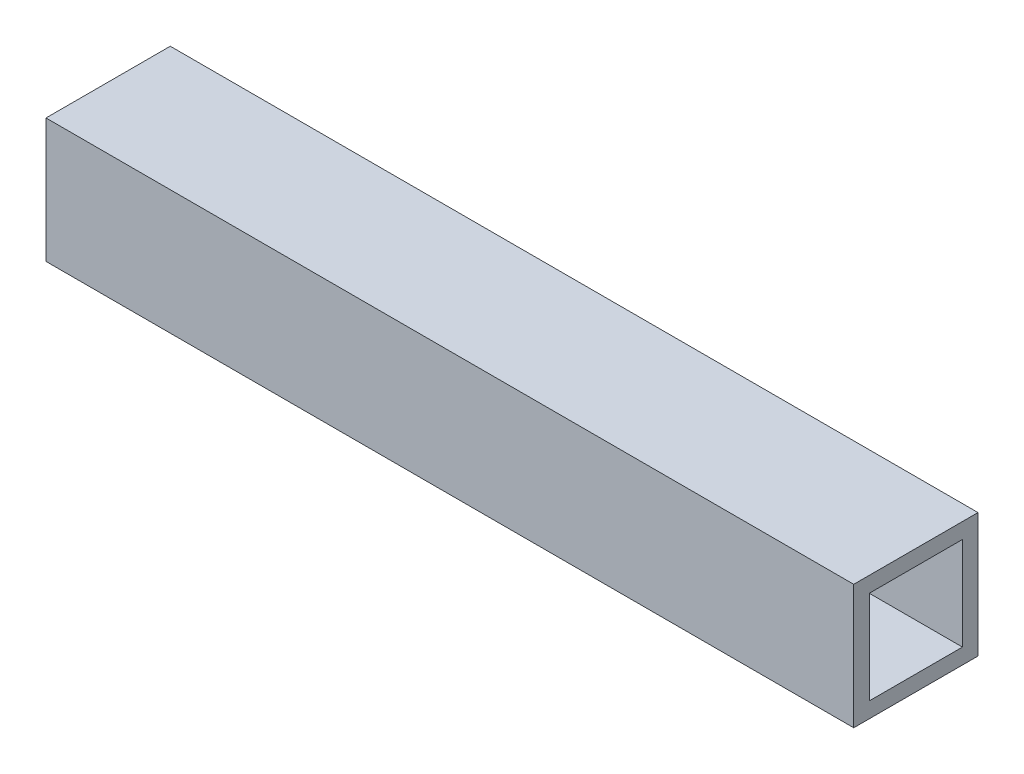
ISO-10303-21;
HEADER;
FILE_DESCRIPTION(('STEP AP214'),'2;1');
FILE_NAME('part.step','',(''),(''),'','','');
FILE_SCHEMA(('AUTOMOTIVE_DESIGN { 1 0 10303 214 1 1 1 1 }'));
ENDSEC;
DATA;
#1=APPLICATION_CONTEXT('core data for automotive mechanical design processes');
#2=APPLICATION_PROTOCOL_DEFINITION('international standard','automotive_design',2000,#1);
#3=PRODUCT_CONTEXT('',#1,'mechanical');
#4=PRODUCT('Part','Part','',(#3));
#5=PRODUCT_RELATED_PRODUCT_CATEGORY('part','',(#4));
#6=PRODUCT_DEFINITION_FORMATION('','',#4);
#7=PRODUCT_DEFINITION_CONTEXT('part definition',#1,'design');
#8=PRODUCT_DEFINITION('design','',#6,#7);
#9=PRODUCT_DEFINITION_SHAPE('','',#8);
#10=(LENGTH_UNIT() NAMED_UNIT(*) SI_UNIT(.MILLI.,.METRE.));
#11=(NAMED_UNIT(*) PLANE_ANGLE_UNIT() SI_UNIT($,.RADIAN.));
#12=(NAMED_UNIT(*) SI_UNIT($,.STERADIAN.) SOLID_ANGLE_UNIT());
#13=UNCERTAINTY_MEASURE_WITH_UNIT(LENGTH_MEASURE(1.E-05),#10,'distance_accuracy_value','');
#14=(GEOMETRIC_REPRESENTATION_CONTEXT(3) GLOBAL_UNCERTAINTY_ASSIGNED_CONTEXT((#13)) GLOBAL_UNIT_ASSIGNED_CONTEXT((#10,
#11,#12)) REPRESENTATION_CONTEXT('',''));
#15=CARTESIAN_POINT('',(0.,0.,0.));
#16=DIRECTION('',(0.,0.,1.));
#17=DIRECTION('',(1.,0.,0.));
#18=AXIS2_PLACEMENT_3D('',#15,#16,#17);
#19=CARTESIAN_POINT('',(165.1,-209.55,22.4741790443659));
#20=DIRECTION('',(0.,-1.,0.));
#21=DIRECTION('',(0.,0.,-1.));
#22=AXIS2_PLACEMENT_3D('',#19,#20,#21);
#23=PLANE('',#22);
#24=DIRECTION('',(0.,0.,1.));
#25=VECTOR('',#24,1.);
#26=CARTESIAN_POINT('',(-165.1,-209.55,22.4741790443659));
#27=LINE('',#26,#25);
#28=CARTESIAN_POINT('',(-165.1,-209.55,6.35));
#29=VERTEX_POINT('',#28);
#30=CARTESIAN_POINT('',(-165.1,-209.55,44.45));
#31=VERTEX_POINT('',#30);
#32=EDGE_CURVE('E156',#29,#31,#27,.T.);
#33=ORIENTED_EDGE('',*,*,#32,.T.);
#34=DIRECTION('',(-1.,0.,0.));
#35=VECTOR('',#34,1.);
#36=CARTESIAN_POINT('',(165.1,-209.55,44.45));
#37=LINE('',#36,#35);
#38=CARTESIAN_POINT('',(165.1,-209.55,44.45));
#39=VERTEX_POINT('',#38);
#40=EDGE_CURVE('E9',#39,#31,#37,.T.);
#41=ORIENTED_EDGE('',*,*,#40,.F.);
#42=DIRECTION('',(0.,0.,1.));
#43=VECTOR('',#42,1.);
#44=CARTESIAN_POINT('',(165.1,-209.55,22.4741790443659));
#45=LINE('',#44,#43);
#46=CARTESIAN_POINT('',(165.1,-209.55,6.35));
#47=VERTEX_POINT('',#46);
#48=EDGE_CURVE('E117',#47,#39,#45,.T.);
#49=ORIENTED_EDGE('',*,*,#48,.F.);
#50=DIRECTION('',(-1.,0.,0.));
#51=VECTOR('',#50,1.);
#52=CARTESIAN_POINT('',(165.1,-209.55,6.35));
#53=LINE('',#52,#51);
#54=EDGE_CURVE('E39',#47,#29,#53,.T.);
#55=ORIENTED_EDGE('',*,*,#54,.T.);
#56=EDGE_LOOP('',(#33,#41,#49,#55));
#57=FACE_BOUND('',#56,.T.);
#58=ADVANCED_FACE('F14',(#57),#23,.F.);
#59=CARTESIAN_POINT('',(165.1,-190.5,44.45));
#60=DIRECTION('',(0.,0.,1.));
#61=DIRECTION('',(1.,0.,0.));
#62=AXIS2_PLACEMENT_3D('',#59,#60,#61);
#63=PLANE('',#62);
#64=DIRECTION('',(0.,1.,0.));
#65=VECTOR('',#64,1.);
#66=CARTESIAN_POINT('',(-165.1,-190.5,44.45));
#67=LINE('',#66,#65);
#68=CARTESIAN_POINT('',(-165.1,-171.45,44.45));
#69=VERTEX_POINT('',#68);
#70=EDGE_CURVE('E124',#31,#69,#67,.T.);
#71=ORIENTED_EDGE('',*,*,#70,.T.);
#72=DIRECTION('',(-1.,0.,0.));
#73=VECTOR('',#72,1.);
#74=CARTESIAN_POINT('',(165.1,-171.45,44.45));
#75=LINE('',#74,#73);
#76=CARTESIAN_POINT('',(165.1,-171.45,44.45));
#77=VERTEX_POINT('',#76);
#78=EDGE_CURVE('E25',#77,#69,#75,.T.);
#79=ORIENTED_EDGE('',*,*,#78,.F.);
#80=DIRECTION('',(0.,1.,0.));
#81=VECTOR('',#80,1.);
#82=CARTESIAN_POINT('',(165.1,-190.5,44.45));
#83=LINE('',#82,#81);
#84=EDGE_CURVE('E111',#39,#77,#83,.T.);
#85=ORIENTED_EDGE('',*,*,#84,.F.);
#86=ORIENTED_EDGE('',*,*,#40,.T.);
#87=EDGE_LOOP('',(#71,#79,#85,#86));
#88=FACE_BOUND('',#87,.T.);
#89=ADVANCED_FACE('F123',(#88),#63,.F.);
#90=CARTESIAN_POINT('',(165.1,-171.45,22.4741790443659));
#91=DIRECTION('',(0.,-1.,0.));
#92=DIRECTION('',(0.,0.,-1.));
#93=AXIS2_PLACEMENT_3D('',#90,#91,#92);
#94=PLANE('',#93);
#95=DIRECTION('',(0.,0.,1.));
#96=VECTOR('',#95,1.);
#97=CARTESIAN_POINT('',(-165.1,-171.45,22.4741790443659));
#98=LINE('',#97,#96);
#99=CARTESIAN_POINT('',(-165.1,-171.45,6.35));
#100=VERTEX_POINT('',#99);
#101=EDGE_CURVE('E160',#100,#69,#98,.T.);
#102=ORIENTED_EDGE('',*,*,#101,.F.);
#103=DIRECTION('',(-1.,0.,0.));
#104=VECTOR('',#103,1.);
#105=CARTESIAN_POINT('',(165.1,-171.45,6.35));
#106=LINE('',#105,#104);
#107=CARTESIAN_POINT('',(165.1,-171.45,6.35));
#108=VERTEX_POINT('',#107);
#109=EDGE_CURVE('E74',#108,#100,#106,.T.);
#110=ORIENTED_EDGE('',*,*,#109,.F.);
#111=DIRECTION('',(0.,0.,1.));
#112=VECTOR('',#111,1.);
#113=CARTESIAN_POINT('',(165.1,-171.45,22.4741790443659));
#114=LINE('',#113,#112);
#115=EDGE_CURVE('E116',#108,#77,#114,.T.);
#116=ORIENTED_EDGE('',*,*,#115,.T.);
#117=ORIENTED_EDGE('',*,*,#78,.T.);
#118=EDGE_LOOP('',(#102,#110,#116,#117));
#119=FACE_BOUND('',#118,.T.);
#120=ADVANCED_FACE('F129',(#119),#94,.T.);
#121=CARTESIAN_POINT('',(165.1,-190.5,50.8));
#122=DIRECTION('',(0.,0.,1.));
#123=DIRECTION('',(1.,0.,0.));
#124=AXIS2_PLACEMENT_3D('',#121,#122,#123);
#125=PLANE('',#124);
#126=DIRECTION('',(0.,1.,0.));
#127=VECTOR('',#126,1.);
#128=CARTESIAN_POINT('',(-165.1,-190.5,50.8));
#129=LINE('',#128,#127);
#130=CARTESIAN_POINT('',(-165.1,-215.9,50.8));
#131=VERTEX_POINT('',#130);
#132=CARTESIAN_POINT('',(-165.1,-165.1,50.8));
#133=VERTEX_POINT('',#132);
#134=EDGE_CURVE('E141',#131,#133,#129,.T.);
#135=ORIENTED_EDGE('',*,*,#134,.F.);
#136=DIRECTION('',(-1.,0.,0.));
#137=VECTOR('',#136,1.);
#138=CARTESIAN_POINT('',(165.1,-215.9,50.8));
#139=LINE('',#138,#137);
#140=CARTESIAN_POINT('',(165.1,-215.9,50.8));
#141=VERTEX_POINT('',#140);
#142=EDGE_CURVE('E18',#141,#131,#139,.T.);
#143=ORIENTED_EDGE('',*,*,#142,.F.);
#144=DIRECTION('',(0.,1.,0.));
#145=VECTOR('',#144,1.);
#146=CARTESIAN_POINT('',(165.1,-190.5,50.8));
#147=LINE('',#146,#145);
#148=CARTESIAN_POINT('',(165.1,-165.1,50.8));
#149=VERTEX_POINT('',#148);
#150=EDGE_CURVE('E166',#141,#149,#147,.T.);
#151=ORIENTED_EDGE('',*,*,#150,.T.);
#152=DIRECTION('',(-1.,0.,0.));
#153=VECTOR('',#152,1.);
#154=CARTESIAN_POINT('',(165.1,-165.1,50.8));
#155=LINE('',#154,#153);
#156=EDGE_CURVE('E137',#149,#133,#155,.T.);
#157=ORIENTED_EDGE('',*,*,#156,.T.);
#158=EDGE_LOOP('',(#135,#143,#151,#157));
#159=FACE_BOUND('',#158,.T.);
#160=ADVANCED_FACE('F16',(#159),#125,.T.);
#161=CARTESIAN_POINT('',(165.1,-215.9,2082.8));
#162=DIRECTION('',(0.,1.,0.));
#163=DIRECTION('',(0.,0.,1.));
#164=AXIS2_PLACEMENT_3D('',#161,#162,#163);
#165=PLANE('',#164);
#166=DIRECTION('',(0.,0.,-1.));
#167=VECTOR('',#166,1.);
#168=CARTESIAN_POINT('',(-165.1,-215.9,2082.8));
#169=LINE('',#168,#167);
#170=CARTESIAN_POINT('',(-165.1,-215.9,0.));
#171=VERTEX_POINT('',#170);
#172=EDGE_CURVE('E145',#131,#171,#169,.T.);
#173=ORIENTED_EDGE('',*,*,#172,.T.);
#174=DIRECTION('',(-1.,0.,0.));
#175=VECTOR('',#174,1.);
#176=CARTESIAN_POINT('',(165.1,-215.9,0.));
#177=LINE('',#176,#175);
#178=CARTESIAN_POINT('',(165.1,-215.9,0.));
#179=VERTEX_POINT('',#178);
#180=EDGE_CURVE('E175',#179,#171,#177,.T.);
#181=ORIENTED_EDGE('',*,*,#180,.F.);
#182=DIRECTION('',(0.,0.,-1.));
#183=VECTOR('',#182,1.);
#184=CARTESIAN_POINT('',(165.1,-215.9,2082.8));
#185=LINE('',#184,#183);
#186=EDGE_CURVE('E187',#141,#179,#185,.T.);
#187=ORIENTED_EDGE('',*,*,#186,.F.);
#188=ORIENTED_EDGE('',*,*,#142,.T.);
#189=EDGE_LOOP('',(#173,#181,#187,#188));
#190=FACE_BOUND('',#189,.T.);
#191=ADVANCED_FACE('F186',(#190),#165,.F.);
#192=CARTESIAN_POINT('',(165.1,-190.5,0.));
#193=DIRECTION('',(0.,0.,1.));
#194=DIRECTION('',(1.,0.,0.));
#195=AXIS2_PLACEMENT_3D('',#192,#193,#194);
#196=PLANE('',#195);
#197=DIRECTION('',(0.,1.,0.));
#198=VECTOR('',#197,1.);
#199=CARTESIAN_POINT('',(-165.1,-190.5,0.));
#200=LINE('',#199,#198);
#201=CARTESIAN_POINT('',(-165.1,-165.1,0.));
#202=VERTEX_POINT('',#201);
#203=EDGE_CURVE('E148',#171,#202,#200,.T.);
#204=ORIENTED_EDGE('',*,*,#203,.T.);
#205=DIRECTION('',(-1.,0.,0.));
#206=VECTOR('',#205,1.);
#207=CARTESIAN_POINT('',(165.1,-165.1,0.));
#208=LINE('',#207,#206);
#209=CARTESIAN_POINT('',(165.1,-165.1,0.));
#210=VERTEX_POINT('',#209);
#211=EDGE_CURVE('E173',#210,#202,#208,.T.);
#212=ORIENTED_EDGE('',*,*,#211,.F.);
#213=DIRECTION('',(0.,1.,0.));
#214=VECTOR('',#213,1.);
#215=CARTESIAN_POINT('',(165.1,-190.5,0.));
#216=LINE('',#215,#214);
#217=EDGE_CURVE('E230',#179,#210,#216,.T.);
#218=ORIENTED_EDGE('',*,*,#217,.F.);
#219=ORIENTED_EDGE('',*,*,#180,.T.);
#220=EDGE_LOOP('',(#204,#212,#218,#219));
#221=FACE_BOUND('',#220,.T.);
#222=ADVANCED_FACE('F199',(#221),#196,.F.);
#223=CARTESIAN_POINT('',(165.1,-165.1,2082.8));
#224=DIRECTION('',(0.,1.,0.));
#225=DIRECTION('',(0.,0.,1.));
#226=AXIS2_PLACEMENT_3D('',#223,#224,#225);
#227=PLANE('',#226);
#228=DIRECTION('',(0.,0.,-1.));
#229=VECTOR('',#228,1.);
#230=CARTESIAN_POINT('',(-165.1,-165.1,2082.8));
#231=LINE('',#230,#229);
#232=EDGE_CURVE('E152',#133,#202,#231,.T.);
#233=ORIENTED_EDGE('',*,*,#232,.F.);
#234=ORIENTED_EDGE('',*,*,#156,.F.);
#235=DIRECTION('',(0.,0.,-1.));
#236=VECTOR('',#235,1.);
#237=CARTESIAN_POINT('',(165.1,-165.1,2082.8));
#238=LINE('',#237,#236);
#239=EDGE_CURVE('E197',#149,#210,#238,.T.);
#240=ORIENTED_EDGE('',*,*,#239,.T.);
#241=ORIENTED_EDGE('',*,*,#211,.T.);
#242=EDGE_LOOP('',(#233,#234,#240,#241));
#243=FACE_BOUND('',#242,.T.);
#244=ADVANCED_FACE('F196',(#243),#227,.T.);
#245=CARTESIAN_POINT('',(165.1,-190.5,6.35));
#246=DIRECTION('',(0.,0.,1.));
#247=DIRECTION('',(1.,0.,0.));
#248=AXIS2_PLACEMENT_3D('',#245,#246,#247);
#249=PLANE('',#248);
#250=DIRECTION('',(0.,1.,0.));
#251=VECTOR('',#250,1.);
#252=CARTESIAN_POINT('',(-165.1,-190.5,6.35));
#253=LINE('',#252,#251);
#254=EDGE_CURVE('E162',#29,#100,#253,.T.);
#255=ORIENTED_EDGE('',*,*,#254,.F.);
#256=ORIENTED_EDGE('',*,*,#54,.F.);
#257=DIRECTION('',(0.,1.,0.));
#258=VECTOR('',#257,1.);
#259=CARTESIAN_POINT('',(165.1,-190.5,6.35));
#260=LINE('',#259,#258);
#261=EDGE_CURVE('E131',#47,#108,#260,.T.);
#262=ORIENTED_EDGE('',*,*,#261,.T.);
#263=ORIENTED_EDGE('',*,*,#109,.T.);
#264=EDGE_LOOP('',(#255,#256,#262,#263));
#265=FACE_BOUND('',#264,.T.);
#266=ADVANCED_FACE('F207',(#265),#249,.T.);
#267=CARTESIAN_POINT('',(165.1,-190.5,1041.4));
#268=DIRECTION('',(1.,0.,0.));
#269=DIRECTION('',(0.,1.,0.));
#270=AXIS2_PLACEMENT_3D('',#267,#268,#269);
#271=PLANE('',#270);
#272=ORIENTED_EDGE('',*,*,#150,.F.);
#273=ORIENTED_EDGE('',*,*,#186,.T.);
#274=ORIENTED_EDGE('',*,*,#217,.T.);
#275=ORIENTED_EDGE('',*,*,#239,.F.);
#276=EDGE_LOOP('',(#272,#273,#274,#275));
#277=FACE_BOUND('',#276,.T.);
#278=ORIENTED_EDGE('',*,*,#48,.T.);
#279=ORIENTED_EDGE('',*,*,#84,.T.);
#280=ORIENTED_EDGE('',*,*,#115,.F.);
#281=ORIENTED_EDGE('',*,*,#261,.F.);
#282=EDGE_LOOP('',(#278,#279,#280,#281));
#283=FACE_BOUND('',#282,.T.);
#284=ADVANCED_FACE('F113',(#277,#283),#271,.T.);
#285=CARTESIAN_POINT('',(-165.1,-190.5,1041.4));
#286=DIRECTION('',(1.,0.,0.));
#287=DIRECTION('',(0.,1.,0.));
#288=AXIS2_PLACEMENT_3D('',#285,#286,#287);
#289=PLANE('',#288);
#290=ORIENTED_EDGE('',*,*,#134,.T.);
#291=ORIENTED_EDGE('',*,*,#232,.T.);
#292=ORIENTED_EDGE('',*,*,#203,.F.);
#293=ORIENTED_EDGE('',*,*,#172,.F.);
#294=EDGE_LOOP('',(#290,#291,#292,#293));
#295=FACE_BOUND('',#294,.T.);
#296=ORIENTED_EDGE('',*,*,#32,.F.);
#297=ORIENTED_EDGE('',*,*,#254,.T.);
#298=ORIENTED_EDGE('',*,*,#101,.T.);
#299=ORIENTED_EDGE('',*,*,#70,.F.);
#300=EDGE_LOOP('',(#296,#297,#298,#299));
#301=FACE_BOUND('',#300,.T.);
#302=ADVANCED_FACE('F190',(#295,#301),#289,.F.);
#303=CLOSED_SHELL('',(#58,#89,#120,#160,#191,#222,#244,#266,#284,#302));
#304=MANIFOLD_SOLID_BREP('B1',#303);
#305=ADVANCED_BREP_SHAPE_REPRESENTATION('',(#18,#304),#14);
#306=SHAPE_DEFINITION_REPRESENTATION(#9,#305);
ENDSEC;
END-ISO-10303-21;
